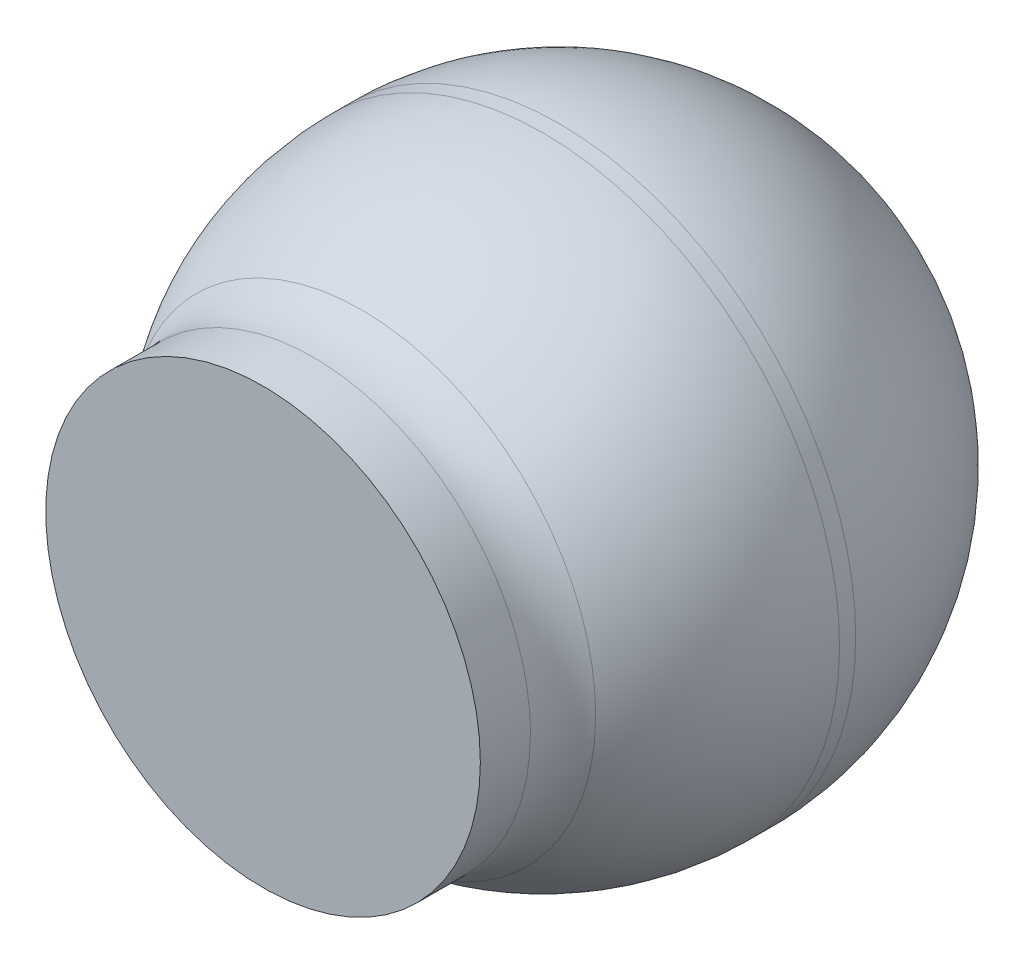
ISO-10303-21;
HEADER;
FILE_DESCRIPTION(('STEP AP214'),'2;1');
FILE_NAME('part.step','',(''),(''),'','','');
FILE_SCHEMA(('AUTOMOTIVE_DESIGN { 1 0 10303 214 1 1 1 1 }'));
ENDSEC;
DATA;
#1=APPLICATION_CONTEXT('core data for automotive mechanical design processes');
#2=APPLICATION_PROTOCOL_DEFINITION('international standard','automotive_design',2000,#1);
#3=PRODUCT_CONTEXT('',#1,'mechanical');
#4=PRODUCT('Part','Part','',(#3));
#5=PRODUCT_RELATED_PRODUCT_CATEGORY('part','',(#4));
#6=PRODUCT_DEFINITION_FORMATION('','',#4);
#7=PRODUCT_DEFINITION_CONTEXT('part definition',#1,'design');
#8=PRODUCT_DEFINITION('design','',#6,#7);
#9=PRODUCT_DEFINITION_SHAPE('','',#8);
#10=(LENGTH_UNIT() NAMED_UNIT(*) SI_UNIT(.MILLI.,.METRE.));
#11=(NAMED_UNIT(*) PLANE_ANGLE_UNIT() SI_UNIT($,.RADIAN.));
#12=(NAMED_UNIT(*) SI_UNIT($,.STERADIAN.) SOLID_ANGLE_UNIT());
#13=UNCERTAINTY_MEASURE_WITH_UNIT(LENGTH_MEASURE(1.E-05),#10,'distance_accuracy_value','');
#14=(GEOMETRIC_REPRESENTATION_CONTEXT(3) GLOBAL_UNCERTAINTY_ASSIGNED_CONTEXT((#13)) GLOBAL_UNIT_ASSIGNED_CONTEXT((#10,
#11,#12)) REPRESENTATION_CONTEXT('',''));
#15=CARTESIAN_POINT('',(0.,0.,0.));
#16=DIRECTION('',(0.,0.,1.));
#17=DIRECTION('',(1.,0.,0.));
#18=AXIS2_PLACEMENT_3D('',#15,#16,#17);
#19=CARTESIAN_POINT('',(1.977080077731,-5.321349291452,10.006534503384));
#20=DIRECTION('',(0.,0.,-1.));
#21=DIRECTION('',(-1.,0.,0.));
#22=AXIS2_PLACEMENT_3D('',#19,#20,#21);
#23=PLANE('',#22);
#24=CARTESIAN_POINT('',(1.977080077731,-5.321349291452,10.006534503384));
#25=DIRECTION('',(0.,0.,1.));
#26=DIRECTION('',(1.,0.,0.));
#27=AXIS2_PLACEMENT_3D('',#24,#25,#26);
#28=CIRCLE('',#27,0.275);
#29=CARTESIAN_POINT('',(2.252080077731,-5.321349291452,10.006534503384));
#30=VERTEX_POINT('',#29);
#31=EDGE_CURVE('E20',#30,#30,#28,.F.);
#32=ORIENTED_EDGE('',*,*,#31,.F.);
#33=EDGE_LOOP('',(#32));
#34=FACE_BOUND('',#33,.T.);
#35=ADVANCED_FACE('F17',(#34),#23,.F.);
#36=CARTESIAN_POINT('',(1.977080077731,-5.321349291452,9.906534503384));
#37=DIRECTION('',(0.,0.,1.));
#38=DIRECTION('',(1.,0.,0.));
#39=AXIS2_PLACEMENT_3D('',#36,#37,#38);
#40=CYLINDRICAL_SURFACE('',#39,0.275);
#41=CARTESIAN_POINT('',(1.977080077731,-5.321349291452,9.943180457728));
#42=DIRECTION('',(0.,0.,-1.));
#43=DIRECTION('',(0.996700902337583,0.0811622527992439,0.));
#44=AXIS2_PLACEMENT_3D('',#41,#42,#43);
#45=CIRCLE('',#44,0.275);
#46=CARTESIAN_POINT('',(2.25117282587384,-5.29902967193221,9.943180457728));
#47=VERTEX_POINT('',#46);
#48=EDGE_CURVE('E65',#47,#47,#45,.F.);
#49=ORIENTED_EDGE('',*,*,#48,.T.);
#50=EDGE_LOOP('',(#49));
#51=FACE_BOUND('',#50,.T.);
#52=ORIENTED_EDGE('',*,*,#31,.T.);
#53=EDGE_LOOP('',(#52));
#54=FACE_BOUND('',#53,.T.);
#55=ADVANCED_FACE('F62',(#51,#54),#40,.T.);
#56=CARTESIAN_POINT('',(1.977080077731,-5.321349291452,9.943180457728));
#57=DIRECTION('',(0.,0.,-1.));
#58=DIRECTION('',(0.996700902337583,0.0811622527992448,0.));
#59=AXIS2_PLACEMENT_3D('',#56,#57,#58);
#60=TOROIDAL_SURFACE('',#59,0.375,0.1);
#61=ORIENTED_EDGE('',*,*,#48,.F.);
#62=EDGE_LOOP('',(#61));
#63=FACE_BOUND('',#62,.T.);
#64=CARTESIAN_POINT('',(1.977080077731,-5.321349291452,9.881744931236));
#65=DIRECTION('',(0.,0.,-1.));
#66=DIRECTION('',(-0.996700902337597,-0.0811622527990622,0.));
#67=AXIS2_PLACEMENT_3D('',#64,#65,#66);
#68=CIRCLE('',#67,0.296097046412665);
#69=CARTESIAN_POINT('',(1.681959884392,-5.345381194786,9.881744931236));
#70=VERTEX_POINT('',#69);
#71=EDGE_CURVE('E39',#70,#70,#68,.T.);
#72=ORIENTED_EDGE('',*,*,#71,.F.);
#73=EDGE_LOOP('',(#72));
#74=FACE_BOUND('',#73,.T.);
#75=ADVANCED_FACE('F57',(#63,#74),#60,.F.);
#76=CARTESIAN_POINT('',(1.603317239355,-5.351785136252,9.651976062157));
#77=CARTESIAN_POINT('',(1.603317239355,-5.351785136252,9.701461392103));
#78=CARTESIAN_POINT('',(1.611473782652,-5.351120941579,9.750947004335));
#79=CARTESIAN_POINT('',(1.627792914651,-5.349792059952,9.798626332798));
#80=CARTESIAN_POINT('',(1.651658609162,-5.347848654938,9.842699544317));
#81=CARTESIAN_POINT('',(1.681959884392,-5.345381194786,9.881744931236));
#82=(BOUNDED_CURVE() B_SPLINE_CURVE(5,(#76,#77,#78,#79,#80,#81),.UNSPECIFIED.,.F.,
.F.) B_SPLINE_CURVE_WITH_KNOTS((6,6),(0.,0.661568582165),
.UNSPECIFIED.) CURVE() GEOMETRIC_REPRESENTATION_ITEM() RATIONAL_B_SPLINE_CURVE((1.,1.,1.,1.,1.,1.)) REPRESENTATION_ITEM(''));
#83=CARTESIAN_POINT('',(1.977080077731,-5.321349291452,9.651976062157));
#84=DIRECTION('',(0.,0.,-1.));
#85=AXIS1_PLACEMENT('',#83,#84);
#86=SURFACE_OF_REVOLUTION('',#82,#85);
#87=CARTESIAN_POINT('',(1.977080077731,-5.321349291452,9.651976062157));
#88=DIRECTION('',(0.,0.,1.));
#89=DIRECTION('',(1.,0.,0.));
#90=AXIS2_PLACEMENT_3D('',#87,#88,#89);
#91=CIRCLE('',#90,0.375);
#92=CARTESIAN_POINT('',(2.352080077731,-5.321349291452,9.651976062157));
#93=VERTEX_POINT('',#92);
#94=EDGE_CURVE('E36',#93,#93,#91,.F.);
#95=ORIENTED_EDGE('',*,*,#94,.F.);
#96=EDGE_LOOP('',(#95));
#97=FACE_BOUND('',#96,.T.);
#98=ORIENTED_EDGE('',*,*,#71,.T.);
#99=EDGE_LOOP('',(#98));
#100=FACE_BOUND('',#99,.T.);
#101=ADVANCED_FACE('F53',(#97,#100),#86,.F.);
#102=CARTESIAN_POINT('',(1.977080077731,-5.321349291452,9.256534503384));
#103=DIRECTION('',(0.,0.,1.));
#104=DIRECTION('',(1.,0.,0.));
#105=AXIS2_PLACEMENT_3D('',#102,#103,#104);
#106=CYLINDRICAL_SURFACE('',#105,0.375);
#107=CARTESIAN_POINT('',(1.977080077731,-5.321349291452,9.631534503384));
#108=DIRECTION('',(0.,0.,-1.));
#109=DIRECTION('',(0.0811622527992357,-0.996700902337583,0.));
#110=AXIS2_PLACEMENT_3D('',#107,#108,#109);
#111=CIRCLE('',#110,0.375);
#112=CARTESIAN_POINT('',(2.00751592253071,-5.69511212982859,9.631534503384));
#113=VERTEX_POINT('',#112);
#114=CARTESIAN_POINT('',(1.94664423293129,-4.94758645307541,9.631534503384));
#115=VERTEX_POINT('',#114);
#116=EDGE_CURVE('E11',#113,#115,#111,.T.);
#117=ORIENTED_EDGE('',*,*,#116,.F.);
#118=CARTESIAN_POINT('',(1.977080077731,-5.321349291452,9.631534503384));
#119=DIRECTION('',(0.,0.,1.));
#120=DIRECTION('',(0.0811622527992365,-0.996700902337583,0.));
#121=AXIS2_PLACEMENT_3D('',#118,#119,#120);
#122=CIRCLE('',#121,0.375);
#123=EDGE_CURVE('E25',#115,#113,#122,.F.);
#124=ORIENTED_EDGE('',*,*,#123,.F.);
#125=EDGE_LOOP('',(#117,#124));
#126=FACE_BOUND('',#125,.T.);
#127=ORIENTED_EDGE('',*,*,#94,.T.);
#128=EDGE_LOOP('',(#127));
#129=FACE_BOUND('',#128,.T.);
#130=ADVANCED_FACE('F34',(#126,#129),#106,.T.);
#131=CARTESIAN_POINT('',(1.977080077731,-5.321349291452,9.631534503384));
#132=DIRECTION('',(0.0811622527992361,-0.996700902337583,0.));
#133=DIRECTION('',(-0.996700902337583,-0.0811622527992361,0.));
#134=AXIS2_PLACEMENT_3D('',#131,#132,#133);
#135=SPHERICAL_SURFACE('',#134,0.375);
#136=ORIENTED_EDGE('',*,*,#123,.T.);
#137=ORIENTED_EDGE('',*,*,#116,.T.);
#138=EDGE_LOOP('',(#136,#137));
#139=FACE_BOUND('',#138,.T.);
#140=ADVANCED_FACE('F32',(#139),#135,.T.);
#141=CLOSED_SHELL('',(#35,#55,#75,#101,#130,#140));
#142=MANIFOLD_SOLID_BREP('B1',#141);
#143=ADVANCED_BREP_SHAPE_REPRESENTATION('',(#18,#142),#14);
#144=SHAPE_DEFINITION_REPRESENTATION(#9,#143);
ENDSEC;
END-ISO-10303-21;
